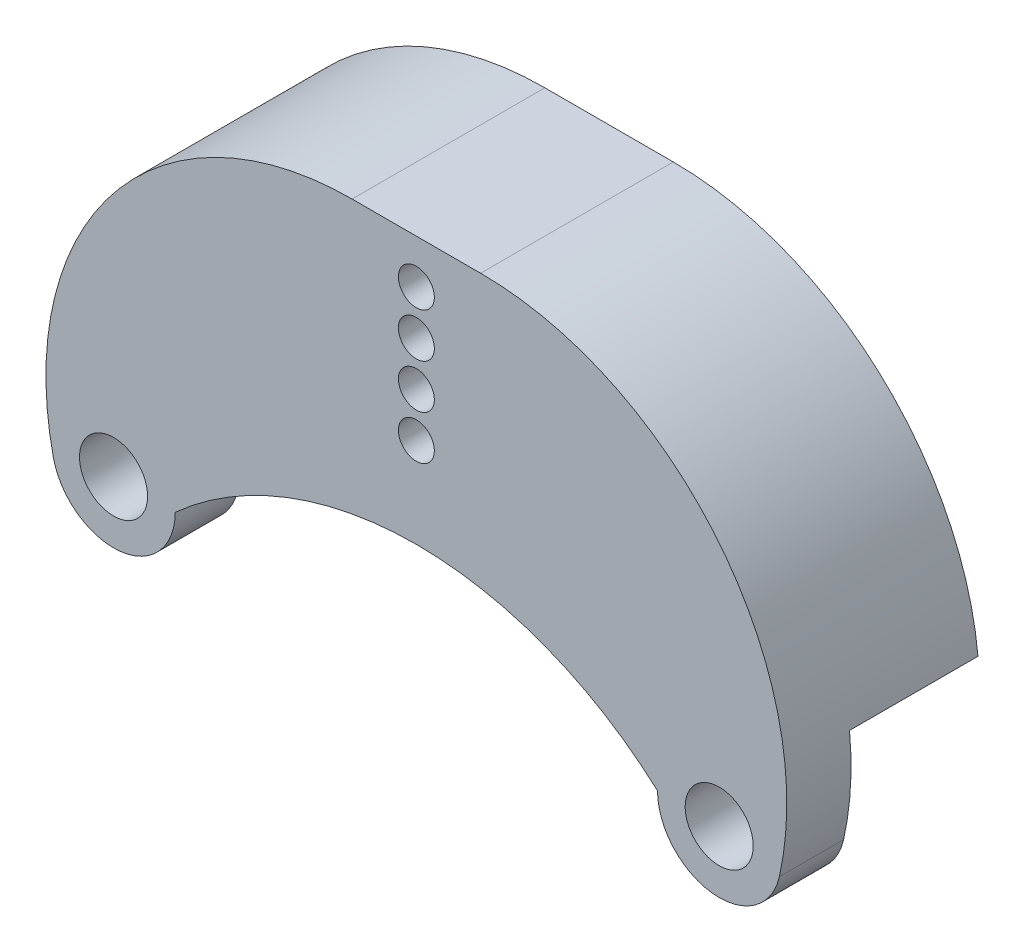
ISO-10303-21;
HEADER;
FILE_DESCRIPTION(('STEP AP214'),'2;1');
FILE_NAME('part.step','',(''),(''),'','','');
FILE_SCHEMA(('AUTOMOTIVE_DESIGN { 1 0 10303 214 1 1 1 1 }'));
ENDSEC;
DATA;
#1=APPLICATION_CONTEXT('core data for automotive mechanical design processes');
#2=APPLICATION_PROTOCOL_DEFINITION('international standard','automotive_design',2000,#1);
#3=PRODUCT_CONTEXT('',#1,'mechanical');
#4=PRODUCT('Part','Part','',(#3));
#5=PRODUCT_RELATED_PRODUCT_CATEGORY('part','',(#4));
#6=PRODUCT_DEFINITION_FORMATION('','',#4);
#7=PRODUCT_DEFINITION_CONTEXT('part definition',#1,'design');
#8=PRODUCT_DEFINITION('design','',#6,#7);
#9=PRODUCT_DEFINITION_SHAPE('','',#8);
#10=(LENGTH_UNIT() NAMED_UNIT(*) SI_UNIT(.MILLI.,.METRE.));
#11=(NAMED_UNIT(*) PLANE_ANGLE_UNIT() SI_UNIT($,.RADIAN.));
#12=(NAMED_UNIT(*) SI_UNIT($,.STERADIAN.) SOLID_ANGLE_UNIT());
#13=UNCERTAINTY_MEASURE_WITH_UNIT(LENGTH_MEASURE(1.E-05),#10,'distance_accuracy_value','');
#14=(GEOMETRIC_REPRESENTATION_CONTEXT(3) GLOBAL_UNCERTAINTY_ASSIGNED_CONTEXT((#13)) GLOBAL_UNIT_ASSIGNED_CONTEXT((#10,
#11,#12)) REPRESENTATION_CONTEXT('',''));
#15=CARTESIAN_POINT('',(0.,0.,0.));
#16=DIRECTION('',(0.,0.,1.));
#17=DIRECTION('',(1.,0.,0.));
#18=AXIS2_PLACEMENT_3D('',#15,#16,#17);
#19=CARTESIAN_POINT('',(-5.,4.16799784482759,0.));
#20=DIRECTION('',(0.,0.,1.));
#21=DIRECTION('',(1.,0.,0.));
#22=AXIS2_PLACEMENT_3D('',#19,#20,#21);
#23=PLANE('',#22);
#24=CARTESIAN_POINT('',(23.57,0.,0.));
#25=DIRECTION('',(0.,0.,1.));
#26=DIRECTION('',(-1.,0.,0.));
#27=AXIS2_PLACEMENT_3D('',#24,#25,#26);
#28=CIRCLE('',#27,2.65);
#29=CARTESIAN_POINT('',(20.92,0.,0.));
#30=VERTEX_POINT('',#29);
#31=EDGE_CURVE('E142',#30,#30,#28,.T.);
#32=ORIENTED_EDGE('',*,*,#31,.T.);
#33=EDGE_LOOP('',(#32));
#34=FACE_BOUND('',#33,.T.);
#35=DIRECTION('',(-1.,0.,0.));
#36=VECTOR('',#35,1.);
#37=CARTESIAN_POINT('',(28.7139487605453,6.53716666666667,0.));
#38=LINE('',#37,#36);
#39=CARTESIAN_POINT('',(28.7139487605453,6.53716666666667,0.));
#40=VERTEX_POINT('',#39);
#41=CARTESIAN_POINT('',(6.15888526227005,6.53716666666668,0.));
#42=VERTEX_POINT('',#41);
#43=EDGE_CURVE('E137',#40,#42,#38,.T.);
#44=ORIENTED_EDGE('',*,*,#43,.F.);
#45=CARTESIAN_POINT('',(5.,4.16799784482759,0.));
#46=DIRECTION('',(0.,0.,1.));
#47=DIRECTION('',(-1.,0.,0.));
#48=AXIS2_PLACEMENT_3D('',#45,#46,#47);
#49=CIRCLE('',#48,23.8320021551724);
#50=CARTESIAN_POINT('',(28.2534799236178,-1.05119731975939,0.));
#51=VERTEX_POINT('',#50);
#52=EDGE_CURVE('E164',#51,#40,#49,.T.);
#53=ORIENTED_EDGE('',*,*,#52,.F.);
#54=CARTESIAN_POINT('',(23.57,0.,0.));
#55=DIRECTION('',(0.,0.,1.));
#56=DIRECTION('',(-1.,0.,0.));
#57=AXIS2_PLACEMENT_3D('',#54,#55,#56);
#58=CIRCLE('',#57,4.80000000000002);
#59=CARTESIAN_POINT('',(18.77,0.,0.));
#60=VERTEX_POINT('',#59);
#61=EDGE_CURVE('E179',#60,#51,#58,.T.);
#62=ORIENTED_EDGE('',*,*,#61,.F.);
#63=CARTESIAN_POINT('',(0.,-20.7770811231992,0.));
#64=DIRECTION('',(0.,0.,-1.));
#65=DIRECTION('',(-1.,0.,0.));
#66=AXIS2_PLACEMENT_3D('',#63,#64,#65);
#67=CIRCLE('',#66,28.);
#68=EDGE_CURVE('E54',#42,#60,#67,.T.);
#69=ORIENTED_EDGE('',*,*,#68,.F.);
#70=EDGE_LOOP('',(#44,#53,#62,#69));
#71=FACE_BOUND('',#70,.T.);
#72=ADVANCED_FACE('F39',(#34,#71),#23,.F.);
#73=CARTESIAN_POINT('',(-23.57,0.,0.));
#74=DIRECTION('',(0.,0.,1.));
#75=DIRECTION('',(1.,0.,0.));
#76=AXIS2_PLACEMENT_3D('',#73,#74,#75);
#77=CIRCLE('',#76,2.65);
#78=CARTESIAN_POINT('',(-20.92,0.,0.));
#79=VERTEX_POINT('',#78);
#80=EDGE_CURVE('E152',#79,#79,#77,.T.);
#81=ORIENTED_EDGE('',*,*,#80,.T.);
#82=EDGE_LOOP('',(#81));
#83=FACE_BOUND('',#82,.T.);
#84=DIRECTION('',(-1.,0.,0.));
#85=VECTOR('',#84,1.);
#86=CARTESIAN_POINT('',(-6.15888526227006,6.53716666666667,0.));
#87=LINE('',#86,#85);
#88=CARTESIAN_POINT('',(-6.15888526227007,6.53716666666667,0.));
#89=VERTEX_POINT('',#88);
#90=CARTESIAN_POINT('',(-28.7139487605453,6.53716666666667,0.));
#91=VERTEX_POINT('',#90);
#92=EDGE_CURVE('E62',#89,#91,#87,.T.);
#93=ORIENTED_EDGE('',*,*,#92,.F.);
#94=CARTESIAN_POINT('',(-18.77,0.,0.));
#95=VERTEX_POINT('',#94);
#96=EDGE_CURVE('E141',#95,#89,#67,.T.);
#97=ORIENTED_EDGE('',*,*,#96,.F.);
#98=CARTESIAN_POINT('',(-23.57,0.,0.));
#99=DIRECTION('',(0.,0.,1.));
#100=DIRECTION('',(1.,0.,0.));
#101=AXIS2_PLACEMENT_3D('',#98,#99,#100);
#102=CIRCLE('',#101,4.8);
#103=CARTESIAN_POINT('',(-28.2534799236178,-1.0511973197594,0.));
#104=VERTEX_POINT('',#103);
#105=EDGE_CURVE('E176',#104,#95,#102,.T.);
#106=ORIENTED_EDGE('',*,*,#105,.F.);
#107=CARTESIAN_POINT('',(-5.,4.16799784482759,0.));
#108=DIRECTION('',(0.,0.,1.));
#109=DIRECTION('',(1.,0.,0.));
#110=AXIS2_PLACEMENT_3D('',#107,#108,#109);
#111=CIRCLE('',#110,23.8320021551724);
#112=EDGE_CURVE('E157',#91,#104,#111,.T.);
#113=ORIENTED_EDGE('',*,*,#112,.F.);
#114=EDGE_LOOP('',(#93,#97,#106,#113));
#115=FACE_BOUND('',#114,.T.);
#116=ADVANCED_FACE('F196',(#83,#115),#23,.F.);
#117=CARTESIAN_POINT('',(-5.,4.16799784482759,5.));
#118=DIRECTION('',(0.,0.,1.));
#119=DIRECTION('',(1.,0.,0.));
#120=AXIS2_PLACEMENT_3D('',#117,#118,#119);
#121=PLANE('',#120);
#122=CARTESIAN_POINT('',(0.,24.5729188768008,5.));
#123=DIRECTION('',(0.,0.,-1.));
#124=DIRECTION('',(-1.,0.,0.));
#125=AXIS2_PLACEMENT_3D('',#122,#123,#124);
#126=CIRCLE('',#125,1.4);
#127=CARTESIAN_POINT('',(-1.4,24.5729188768008,5.));
#128=VERTEX_POINT('',#127);
#129=EDGE_CURVE('E213',#128,#128,#126,.T.);
#130=ORIENTED_EDGE('',*,*,#129,.T.);
#131=EDGE_LOOP('',(#130));
#132=FACE_BOUND('',#131,.T.);
#133=CARTESIAN_POINT('',(0.,21.1229188768008,5.));
#134=DIRECTION('',(0.,0.,-1.));
#135=DIRECTION('',(-1.,0.,0.));
#136=AXIS2_PLACEMENT_3D('',#133,#134,#135);
#137=CIRCLE('',#136,1.4);
#138=CARTESIAN_POINT('',(-1.4,21.1229188768008,5.));
#139=VERTEX_POINT('',#138);
#140=EDGE_CURVE('E294',#139,#139,#137,.T.);
#141=ORIENTED_EDGE('',*,*,#140,.T.);
#142=EDGE_LOOP('',(#141));
#143=FACE_BOUND('',#142,.T.);
#144=CARTESIAN_POINT('',(0.,17.6729188768008,5.));
#145=DIRECTION('',(0.,0.,-1.));
#146=DIRECTION('',(-1.,0.,0.));
#147=AXIS2_PLACEMENT_3D('',#144,#145,#146);
#148=CIRCLE('',#147,1.4);
#149=CARTESIAN_POINT('',(-1.4,17.6729188768008,5.));
#150=VERTEX_POINT('',#149);
#151=EDGE_CURVE('E302',#150,#150,#148,.T.);
#152=ORIENTED_EDGE('',*,*,#151,.T.);
#153=EDGE_LOOP('',(#152));
#154=FACE_BOUND('',#153,.T.);
#155=CARTESIAN_POINT('',(0.,14.2229188768008,5.));
#156=DIRECTION('',(0.,0.,-1.));
#157=DIRECTION('',(-1.,0.,0.));
#158=AXIS2_PLACEMENT_3D('',#155,#156,#157);
#159=CIRCLE('',#158,1.4);
#160=CARTESIAN_POINT('',(-1.4,14.2229188768008,5.));
#161=VERTEX_POINT('',#160);
#162=EDGE_CURVE('E308',#161,#161,#159,.T.);
#163=ORIENTED_EDGE('',*,*,#162,.T.);
#164=EDGE_LOOP('',(#163));
#165=FACE_BOUND('',#164,.T.);
#166=CARTESIAN_POINT('',(-23.57,0.,5.));
#167=DIRECTION('',(0.,0.,1.));
#168=DIRECTION('',(1.,0.,0.));
#169=AXIS2_PLACEMENT_3D('',#166,#167,#168);
#170=CIRCLE('',#169,2.65);
#171=CARTESIAN_POINT('',(-20.92,0.,5.));
#172=VERTEX_POINT('',#171);
#173=EDGE_CURVE('E154',#172,#172,#170,.T.);
#174=ORIENTED_EDGE('',*,*,#173,.F.);
#175=EDGE_LOOP('',(#174));
#176=FACE_BOUND('',#175,.T.);
#177=CARTESIAN_POINT('',(-5.,4.16799784482759,5.));
#178=DIRECTION('',(0.,0.,1.));
#179=DIRECTION('',(1.,0.,0.));
#180=AXIS2_PLACEMENT_3D('',#177,#178,#179);
#181=CIRCLE('',#180,23.8320021551724);
#182=CARTESIAN_POINT('',(-5.,28.,5.));
#183=VERTEX_POINT('',#182);
#184=CARTESIAN_POINT('',(-28.2534799236178,-1.0511973197594,5.));
#185=VERTEX_POINT('',#184);
#186=EDGE_CURVE('E160',#183,#185,#181,.T.);
#187=ORIENTED_EDGE('',*,*,#186,.T.);
#188=CARTESIAN_POINT('',(-23.57,0.,5.));
#189=DIRECTION('',(0.,0.,1.));
#190=DIRECTION('',(1.,0.,0.));
#191=AXIS2_PLACEMENT_3D('',#188,#189,#190);
#192=CIRCLE('',#191,4.8);
#193=CARTESIAN_POINT('',(-18.77,0.,5.));
#194=VERTEX_POINT('',#193);
#195=EDGE_CURVE('E163',#185,#194,#192,.T.);
#196=ORIENTED_EDGE('',*,*,#195,.T.);
#197=CARTESIAN_POINT('',(0.,-20.7770811231992,5.));
#198=DIRECTION('',(0.,0.,-1.));
#199=DIRECTION('',(-1.,0.,0.));
#200=AXIS2_PLACEMENT_3D('',#197,#198,#199);
#201=CIRCLE('',#200,28.);
#202=CARTESIAN_POINT('',(18.77,0.,5.));
#203=VERTEX_POINT('',#202);
#204=EDGE_CURVE('E166',#194,#203,#201,.T.);
#205=ORIENTED_EDGE('',*,*,#204,.T.);
#206=CARTESIAN_POINT('',(23.57,0.,5.));
#207=DIRECTION('',(0.,0.,1.));
#208=DIRECTION('',(-1.,0.,0.));
#209=AXIS2_PLACEMENT_3D('',#206,#207,#208);
#210=CIRCLE('',#209,4.80000000000002);
#211=CARTESIAN_POINT('',(28.2534799236178,-1.05119731975939,5.));
#212=VERTEX_POINT('',#211);
#213=EDGE_CURVE('E168',#203,#212,#210,.T.);
#214=ORIENTED_EDGE('',*,*,#213,.T.);
#215=CARTESIAN_POINT('',(5.,4.16799784482759,5.));
#216=DIRECTION('',(0.,0.,1.));
#217=DIRECTION('',(-1.,0.,0.));
#218=AXIS2_PLACEMENT_3D('',#215,#216,#217);
#219=CIRCLE('',#218,23.8320021551724);
#220=CARTESIAN_POINT('',(5.,28.,5.));
#221=VERTEX_POINT('',#220);
#222=EDGE_CURVE('E170',#212,#221,#219,.T.);
#223=ORIENTED_EDGE('',*,*,#222,.T.);
#224=DIRECTION('',(-1.,0.,0.));
#225=VECTOR('',#224,1.);
#226=CARTESIAN_POINT('',(5.,28.,5.));
#227=LINE('',#226,#225);
#228=EDGE_CURVE('E172',#221,#183,#227,.T.);
#229=ORIENTED_EDGE('',*,*,#228,.T.);
#230=EDGE_LOOP('',(#187,#196,#205,#214,#223,#229));
#231=FACE_BOUND('',#230,.T.);
#232=CARTESIAN_POINT('',(23.57,0.,5.));
#233=DIRECTION('',(0.,0.,1.));
#234=DIRECTION('',(-1.,0.,0.));
#235=AXIS2_PLACEMENT_3D('',#232,#233,#234);
#236=CIRCLE('',#235,2.65);
#237=CARTESIAN_POINT('',(20.92,0.,5.));
#238=VERTEX_POINT('',#237);
#239=EDGE_CURVE('E145',#238,#238,#236,.T.);
#240=ORIENTED_EDGE('',*,*,#239,.F.);
#241=EDGE_LOOP('',(#240));
#242=FACE_BOUND('',#241,.T.);
#243=ADVANCED_FACE('F230',(#132,#143,#154,#165,#176,#231,#242),#121,.T.);
#244=CARTESIAN_POINT('',(-5.,4.16799784482759,5.));
#245=DIRECTION('',(0.,0.,-1.));
#246=DIRECTION('',(-1.,0.,0.));
#247=AXIS2_PLACEMENT_3D('',#244,#245,#246);
#248=CYLINDRICAL_SURFACE('',#247,23.8320021551724);
#249=DIRECTION('',(0.,0.,-1.));
#250=VECTOR('',#249,1.);
#251=CARTESIAN_POINT('',(-5.,28.,5.));
#252=LINE('',#251,#250);
#253=CARTESIAN_POINT('',(-5.,28.,-10.));
#254=VERTEX_POINT('',#253);
#255=EDGE_CURVE('E174',#183,#254,#252,.T.);
#256=ORIENTED_EDGE('',*,*,#255,.T.);
#257=CARTESIAN_POINT('',(-5.,4.16799784482759,-10.));
#258=DIRECTION('',(0.,0.,-1.));
#259=DIRECTION('',(-1.,0.,0.));
#260=AXIS2_PLACEMENT_3D('',#257,#258,#259);
#261=CIRCLE('',#260,23.8320021551724);
#262=CARTESIAN_POINT('',(-28.7139487605453,6.53716666666667,-10.));
#263=VERTEX_POINT('',#262);
#264=EDGE_CURVE('E127',#263,#254,#261,.T.);
#265=ORIENTED_EDGE('',*,*,#264,.F.);
#266=DIRECTION('',(0.,0.,1.));
#267=VECTOR('',#266,1.);
#268=CARTESIAN_POINT('',(-28.7139487605453,6.53716666666667,-10.));
#269=LINE('',#268,#267);
#270=EDGE_CURVE('E123',#263,#91,#269,.T.);
#271=ORIENTED_EDGE('',*,*,#270,.T.);
#272=ORIENTED_EDGE('',*,*,#112,.T.);
#273=DIRECTION('',(0.,0.,-1.));
#274=VECTOR('',#273,1.);
#275=CARTESIAN_POINT('',(-28.2534799236178,-1.0511973197594,5.));
#276=LINE('',#275,#274);
#277=EDGE_CURVE('E11',#185,#104,#276,.T.);
#278=ORIENTED_EDGE('',*,*,#277,.F.);
#279=ORIENTED_EDGE('',*,*,#186,.F.);
#280=EDGE_LOOP('',(#256,#265,#271,#272,#278,#279));
#281=FACE_BOUND('',#280,.T.);
#282=ADVANCED_FACE('F41',(#281),#248,.T.);
#283=CARTESIAN_POINT('',(-23.57,0.,5.));
#284=DIRECTION('',(0.,0.,-1.));
#285=DIRECTION('',(-1.,0.,0.));
#286=AXIS2_PLACEMENT_3D('',#283,#284,#285);
#287=CYLINDRICAL_SURFACE('',#286,4.8);
#288=ORIENTED_EDGE('',*,*,#105,.T.);
#289=DIRECTION('',(0.,0.,-1.));
#290=VECTOR('',#289,1.);
#291=CARTESIAN_POINT('',(-18.77,0.,5.));
#292=LINE('',#291,#290);
#293=EDGE_CURVE('E47',#194,#95,#292,.T.);
#294=ORIENTED_EDGE('',*,*,#293,.F.);
#295=ORIENTED_EDGE('',*,*,#195,.F.);
#296=ORIENTED_EDGE('',*,*,#277,.T.);
#297=EDGE_LOOP('',(#288,#294,#295,#296));
#298=FACE_BOUND('',#297,.T.);
#299=ADVANCED_FACE('F198',(#298),#287,.T.);
#300=CARTESIAN_POINT('',(0.,-20.7770811231992,5.));
#301=DIRECTION('',(0.,0.,-1.));
#302=DIRECTION('',(-1.,0.,0.));
#303=AXIS2_PLACEMENT_3D('',#300,#301,#302);
#304=CYLINDRICAL_SURFACE('',#303,28.);
#305=ORIENTED_EDGE('',*,*,#96,.T.);
#306=DIRECTION('',(0.,0.,1.));
#307=VECTOR('',#306,1.);
#308=CARTESIAN_POINT('',(-6.15888526227006,6.53716666666667,-10.));
#309=LINE('',#308,#307);
#310=CARTESIAN_POINT('',(-6.15888526227006,6.53716666666667,-10.));
#311=VERTEX_POINT('',#310);
#312=EDGE_CURVE('E121',#311,#89,#309,.T.);
#313=ORIENTED_EDGE('',*,*,#312,.F.);
#314=CARTESIAN_POINT('',(0.,-20.7770811231992,-10.));
#315=DIRECTION('',(0.,0.,1.));
#316=DIRECTION('',(-1.,0.,0.));
#317=AXIS2_PLACEMENT_3D('',#314,#315,#316);
#318=CIRCLE('',#317,28.);
#319=CARTESIAN_POINT('',(6.15888526227006,6.53716666666667,-10.));
#320=VERTEX_POINT('',#319);
#321=EDGE_CURVE('E128',#320,#311,#318,.T.);
#322=ORIENTED_EDGE('',*,*,#321,.F.);
#323=DIRECTION('',(0.,0.,1.));
#324=VECTOR('',#323,1.);
#325=CARTESIAN_POINT('',(6.15888526227006,6.53716666666667,-10.));
#326=LINE('',#325,#324);
#327=EDGE_CURVE('E211',#320,#42,#326,.T.);
#328=ORIENTED_EDGE('',*,*,#327,.T.);
#329=ORIENTED_EDGE('',*,*,#68,.T.);
#330=DIRECTION('',(0.,0.,-1.));
#331=VECTOR('',#330,1.);
#332=CARTESIAN_POINT('',(18.77,0.,5.));
#333=LINE('',#332,#331);
#334=EDGE_CURVE('E189',#203,#60,#333,.T.);
#335=ORIENTED_EDGE('',*,*,#334,.F.);
#336=ORIENTED_EDGE('',*,*,#204,.F.);
#337=ORIENTED_EDGE('',*,*,#293,.T.);
#338=EDGE_LOOP('',(#305,#313,#322,#328,#329,#335,#336,#337));
#339=FACE_BOUND('',#338,.T.);
#340=ADVANCED_FACE('F139',(#339),#304,.F.);
#341=CARTESIAN_POINT('',(23.57,0.,5.));
#342=DIRECTION('',(0.,0.,-1.));
#343=DIRECTION('',(-1.,0.,0.));
#344=AXIS2_PLACEMENT_3D('',#341,#342,#343);
#345=CYLINDRICAL_SURFACE('',#344,4.80000000000002);
#346=ORIENTED_EDGE('',*,*,#61,.T.);
#347=DIRECTION('',(0.,0.,-1.));
#348=VECTOR('',#347,1.);
#349=CARTESIAN_POINT('',(28.2534799236178,-1.05119731975939,5.));
#350=LINE('',#349,#348);
#351=EDGE_CURVE('E186',#212,#51,#350,.T.);
#352=ORIENTED_EDGE('',*,*,#351,.F.);
#353=ORIENTED_EDGE('',*,*,#213,.F.);
#354=ORIENTED_EDGE('',*,*,#334,.T.);
#355=EDGE_LOOP('',(#346,#352,#353,#354));
#356=FACE_BOUND('',#355,.T.);
#357=ADVANCED_FACE('F227',(#356),#345,.T.);
#358=CARTESIAN_POINT('',(5.,4.16799784482759,5.));
#359=DIRECTION('',(0.,0.,-1.));
#360=DIRECTION('',(-1.,0.,0.));
#361=AXIS2_PLACEMENT_3D('',#358,#359,#360);
#362=CYLINDRICAL_SURFACE('',#361,23.8320021551724);
#363=ORIENTED_EDGE('',*,*,#52,.T.);
#364=DIRECTION('',(0.,0.,1.));
#365=VECTOR('',#364,1.);
#366=CARTESIAN_POINT('',(28.7139487605453,6.53716666666667,-10.));
#367=LINE('',#366,#365);
#368=CARTESIAN_POINT('',(28.7139487605453,6.53716666666667,-10.));
#369=VERTEX_POINT('',#368);
#370=EDGE_CURVE('E147',#369,#40,#367,.T.);
#371=ORIENTED_EDGE('',*,*,#370,.F.);
#372=CARTESIAN_POINT('',(5.,4.16799784482759,-10.));
#373=DIRECTION('',(0.,0.,-1.));
#374=DIRECTION('',(-1.,0.,0.));
#375=AXIS2_PLACEMENT_3D('',#372,#373,#374);
#376=CIRCLE('',#375,23.8320021551724);
#377=CARTESIAN_POINT('',(5.,28.,-10.));
#378=VERTEX_POINT('',#377);
#379=EDGE_CURVE('E206',#378,#369,#376,.T.);
#380=ORIENTED_EDGE('',*,*,#379,.F.);
#381=DIRECTION('',(0.,0.,-1.));
#382=VECTOR('',#381,1.);
#383=CARTESIAN_POINT('',(5.,28.,5.));
#384=LINE('',#383,#382);
#385=EDGE_CURVE('E184',#221,#378,#384,.T.);
#386=ORIENTED_EDGE('',*,*,#385,.F.);
#387=ORIENTED_EDGE('',*,*,#222,.F.);
#388=ORIENTED_EDGE('',*,*,#351,.T.);
#389=EDGE_LOOP('',(#363,#371,#380,#386,#387,#388));
#390=FACE_BOUND('',#389,.T.);
#391=ADVANCED_FACE('F221',(#390),#362,.T.);
#392=CARTESIAN_POINT('',(5.,28.,5.));
#393=DIRECTION('',(0.,-1.,0.));
#394=DIRECTION('',(0.,0.,-1.));
#395=AXIS2_PLACEMENT_3D('',#392,#393,#394);
#396=PLANE('',#395);
#397=ORIENTED_EDGE('',*,*,#385,.T.);
#398=DIRECTION('',(1.,0.,0.));
#399=VECTOR('',#398,1.);
#400=CARTESIAN_POINT('',(-5.,28.,-10.));
#401=LINE('',#400,#399);
#402=EDGE_CURVE('E204',#254,#378,#401,.T.);
#403=ORIENTED_EDGE('',*,*,#402,.F.);
#404=ORIENTED_EDGE('',*,*,#255,.F.);
#405=ORIENTED_EDGE('',*,*,#228,.F.);
#406=EDGE_LOOP('',(#397,#403,#404,#405));
#407=FACE_BOUND('',#406,.T.);
#408=ADVANCED_FACE('F234',(#407),#396,.F.);
#409=CARTESIAN_POINT('',(-23.57,0.,5.));
#410=DIRECTION('',(0.,0.,-1.));
#411=DIRECTION('',(-1.,0.,0.));
#412=AXIS2_PLACEMENT_3D('',#409,#410,#411);
#413=CYLINDRICAL_SURFACE('',#412,2.65);
#414=ORIENTED_EDGE('',*,*,#173,.T.);
#415=EDGE_LOOP('',(#414));
#416=FACE_BOUND('',#415,.T.);
#417=ORIENTED_EDGE('',*,*,#80,.F.);
#418=EDGE_LOOP('',(#417));
#419=FACE_BOUND('',#418,.T.);
#420=ADVANCED_FACE('F236',(#416,#419),#413,.F.);
#421=CARTESIAN_POINT('',(23.57,0.,5.));
#422=DIRECTION('',(0.,0.,-1.));
#423=DIRECTION('',(-1.,0.,0.));
#424=AXIS2_PLACEMENT_3D('',#421,#422,#423);
#425=CYLINDRICAL_SURFACE('',#424,2.65);
#426=ORIENTED_EDGE('',*,*,#239,.T.);
#427=EDGE_LOOP('',(#426));
#428=FACE_BOUND('',#427,.T.);
#429=ORIENTED_EDGE('',*,*,#31,.F.);
#430=EDGE_LOOP('',(#429));
#431=FACE_BOUND('',#430,.T.);
#432=ADVANCED_FACE('F243',(#428,#431),#425,.F.);
#433=CARTESIAN_POINT('',(-6.15888526227006,6.53716666666667,-10.));
#434=DIRECTION('',(0.,1.,0.));
#435=DIRECTION('',(-1.,0.,0.));
#436=AXIS2_PLACEMENT_3D('',#433,#434,#435);
#437=PLANE('',#436);
#438=ORIENTED_EDGE('',*,*,#92,.T.);
#439=ORIENTED_EDGE('',*,*,#270,.F.);
#440=DIRECTION('',(-1.,0.,0.));
#441=VECTOR('',#440,1.);
#442=CARTESIAN_POINT('',(-6.15888526227006,6.53716666666667,-10.));
#443=LINE('',#442,#441);
#444=EDGE_CURVE('E117',#311,#263,#443,.T.);
#445=ORIENTED_EDGE('',*,*,#444,.F.);
#446=ORIENTED_EDGE('',*,*,#312,.T.);
#447=EDGE_LOOP('',(#438,#439,#445,#446));
#448=FACE_BOUND('',#447,.T.);
#449=ADVANCED_FACE('F119',(#448),#437,.F.);
#450=CARTESIAN_POINT('',(28.7139487605453,6.53716666666667,-10.));
#451=DIRECTION('',(0.,1.,0.));
#452=DIRECTION('',(-1.,0.,0.));
#453=AXIS2_PLACEMENT_3D('',#450,#451,#452);
#454=PLANE('',#453);
#455=ORIENTED_EDGE('',*,*,#43,.T.);
#456=ORIENTED_EDGE('',*,*,#327,.F.);
#457=DIRECTION('',(-1.,0.,0.));
#458=VECTOR('',#457,1.);
#459=CARTESIAN_POINT('',(28.7139487605453,6.53716666666667,-10.));
#460=LINE('',#459,#458);
#461=EDGE_CURVE('E133',#369,#320,#460,.T.);
#462=ORIENTED_EDGE('',*,*,#461,.F.);
#463=ORIENTED_EDGE('',*,*,#370,.T.);
#464=EDGE_LOOP('',(#455,#456,#462,#463));
#465=FACE_BOUND('',#464,.T.);
#466=ADVANCED_FACE('F218',(#465),#454,.F.);
#467=CARTESIAN_POINT('',(0.,-20.7770811231992,-10.));
#468=DIRECTION('',(0.,0.,-1.));
#469=DIRECTION('',(-1.,0.,0.));
#470=AXIS2_PLACEMENT_3D('',#467,#468,#469);
#471=PLANE('',#470);
#472=CARTESIAN_POINT('',(0.,24.5729188768008,-10.));
#473=DIRECTION('',(0.,0.,-1.));
#474=DIRECTION('',(-1.,0.,0.));
#475=AXIS2_PLACEMENT_3D('',#472,#473,#474);
#476=CIRCLE('',#475,1.4);
#477=CARTESIAN_POINT('',(-1.4,24.5729188768008,-10.));
#478=VERTEX_POINT('',#477);
#479=EDGE_CURVE('E289',#478,#478,#476,.T.);
#480=ORIENTED_EDGE('',*,*,#479,.F.);
#481=EDGE_LOOP('',(#480));
#482=FACE_BOUND('',#481,.T.);
#483=CARTESIAN_POINT('',(0.,21.1229188768008,-10.));
#484=DIRECTION('',(0.,0.,-1.));
#485=DIRECTION('',(-1.,0.,0.));
#486=AXIS2_PLACEMENT_3D('',#483,#484,#485);
#487=CIRCLE('',#486,1.4);
#488=CARTESIAN_POINT('',(-1.4,21.1229188768008,-10.));
#489=VERTEX_POINT('',#488);
#490=EDGE_CURVE('E290',#489,#489,#487,.T.);
#491=ORIENTED_EDGE('',*,*,#490,.F.);
#492=EDGE_LOOP('',(#491));
#493=FACE_BOUND('',#492,.T.);
#494=CARTESIAN_POINT('',(0.,17.6729188768008,-10.));
#495=DIRECTION('',(0.,0.,-1.));
#496=DIRECTION('',(-1.,0.,0.));
#497=AXIS2_PLACEMENT_3D('',#494,#495,#496);
#498=CIRCLE('',#497,1.4);
#499=CARTESIAN_POINT('',(-1.4,17.6729188768008,-10.));
#500=VERTEX_POINT('',#499);
#501=EDGE_CURVE('E299',#500,#500,#498,.T.);
#502=ORIENTED_EDGE('',*,*,#501,.F.);
#503=EDGE_LOOP('',(#502));
#504=FACE_BOUND('',#503,.T.);
#505=CARTESIAN_POINT('',(0.,14.2229188768008,-10.));
#506=DIRECTION('',(0.,0.,-1.));
#507=DIRECTION('',(-1.,0.,0.));
#508=AXIS2_PLACEMENT_3D('',#505,#506,#507);
#509=CIRCLE('',#508,1.4);
#510=CARTESIAN_POINT('',(-1.4,14.2229188768008,-10.));
#511=VERTEX_POINT('',#510);
#512=EDGE_CURVE('E305',#511,#511,#509,.T.);
#513=ORIENTED_EDGE('',*,*,#512,.F.);
#514=EDGE_LOOP('',(#513));
#515=FACE_BOUND('',#514,.T.);
#516=ORIENTED_EDGE('',*,*,#321,.T.);
#517=ORIENTED_EDGE('',*,*,#444,.T.);
#518=ORIENTED_EDGE('',*,*,#264,.T.);
#519=ORIENTED_EDGE('',*,*,#402,.T.);
#520=ORIENTED_EDGE('',*,*,#379,.T.);
#521=ORIENTED_EDGE('',*,*,#461,.T.);
#522=EDGE_LOOP('',(#516,#517,#518,#519,#520,#521));
#523=FACE_BOUND('',#522,.T.);
#524=ADVANCED_FACE('F131',(#482,#493,#504,#515,#523),#471,.T.);
#525=CARTESIAN_POINT('',(0.,14.2229188768008,5.));
#526=DIRECTION('',(0.,0.,-1.));
#527=DIRECTION('',(-1.,0.,0.));
#528=AXIS2_PLACEMENT_3D('',#525,#526,#527);
#529=CYLINDRICAL_SURFACE('',#528,1.4);
#530=ORIENTED_EDGE('',*,*,#162,.F.);
#531=EDGE_LOOP('',(#530));
#532=FACE_BOUND('',#531,.T.);
#533=ORIENTED_EDGE('',*,*,#512,.T.);
#534=EDGE_LOOP('',(#533));
#535=FACE_BOUND('',#534,.T.);
#536=ADVANCED_FACE('F266',(#532,#535),#529,.F.);
#537=CARTESIAN_POINT('',(0.,17.6729188768008,5.));
#538=DIRECTION('',(0.,0.,-1.));
#539=DIRECTION('',(-1.,0.,0.));
#540=AXIS2_PLACEMENT_3D('',#537,#538,#539);
#541=CYLINDRICAL_SURFACE('',#540,1.4);
#542=ORIENTED_EDGE('',*,*,#151,.F.);
#543=EDGE_LOOP('',(#542));
#544=FACE_BOUND('',#543,.T.);
#545=ORIENTED_EDGE('',*,*,#501,.T.);
#546=EDGE_LOOP('',(#545));
#547=FACE_BOUND('',#546,.T.);
#548=ADVANCED_FACE('F270',(#544,#547),#541,.F.);
#549=CARTESIAN_POINT('',(0.,21.1229188768008,5.));
#550=DIRECTION('',(0.,0.,-1.));
#551=DIRECTION('',(-1.,0.,0.));
#552=AXIS2_PLACEMENT_3D('',#549,#550,#551);
#553=CYLINDRICAL_SURFACE('',#552,1.4);
#554=ORIENTED_EDGE('',*,*,#140,.F.);
#555=EDGE_LOOP('',(#554));
#556=FACE_BOUND('',#555,.T.);
#557=ORIENTED_EDGE('',*,*,#490,.T.);
#558=EDGE_LOOP('',(#557));
#559=FACE_BOUND('',#558,.T.);
#560=ADVANCED_FACE('F274',(#556,#559),#553,.F.);
#561=CARTESIAN_POINT('',(0.,24.5729188768008,5.));
#562=DIRECTION('',(0.,0.,-1.));
#563=DIRECTION('',(-1.,0.,0.));
#564=AXIS2_PLACEMENT_3D('',#561,#562,#563);
#565=CYLINDRICAL_SURFACE('',#564,1.4);
#566=ORIENTED_EDGE('',*,*,#129,.F.);
#567=EDGE_LOOP('',(#566));
#568=FACE_BOUND('',#567,.T.);
#569=ORIENTED_EDGE('',*,*,#479,.T.);
#570=EDGE_LOOP('',(#569));
#571=FACE_BOUND('',#570,.T.);
#572=ADVANCED_FACE('F278',(#568,#571),#565,.F.);
#573=CLOSED_SHELL('',(#72,#116,#243,#282,#299,#340,#357,#391,#408,#420,#432,#449,#466,#524,#536,
#548,#560,#572));
#574=MANIFOLD_SOLID_BREP('B2',#573);
#575=ADVANCED_BREP_SHAPE_REPRESENTATION('',(#18,#574),#14);
#576=SHAPE_DEFINITION_REPRESENTATION(#9,#575);
ENDSEC;
END-ISO-10303-21;
